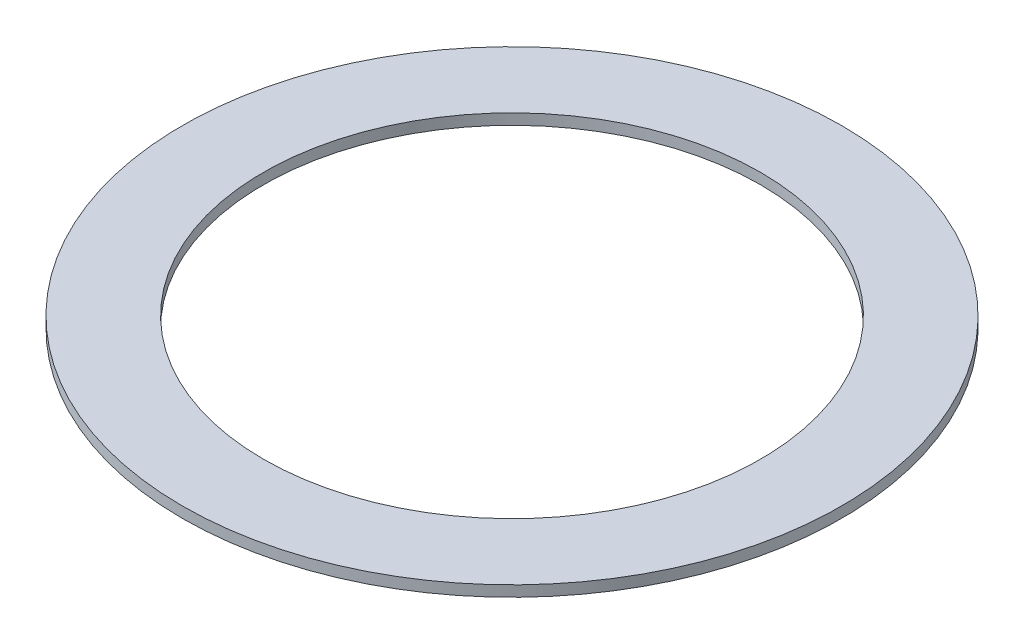
ISO-10303-21;
HEADER;
FILE_DESCRIPTION(('STEP AP214'),'2;1');
FILE_NAME('part.step','',(''),(''),'','','');
FILE_SCHEMA(('AUTOMOTIVE_DESIGN { 1 0 10303 214 1 1 1 1 }'));
ENDSEC;
DATA;
#1=APPLICATION_CONTEXT('core data for automotive mechanical design processes');
#2=APPLICATION_PROTOCOL_DEFINITION('international standard','automotive_design',2000,#1);
#3=PRODUCT_CONTEXT('',#1,'mechanical');
#4=PRODUCT('Part','Part','',(#3));
#5=PRODUCT_RELATED_PRODUCT_CATEGORY('part','',(#4));
#6=PRODUCT_DEFINITION_FORMATION('','',#4);
#7=PRODUCT_DEFINITION_CONTEXT('part definition',#1,'design');
#8=PRODUCT_DEFINITION('design','',#6,#7);
#9=PRODUCT_DEFINITION_SHAPE('','',#8);
#10=(LENGTH_UNIT() NAMED_UNIT(*) SI_UNIT(.MILLI.,.METRE.));
#11=(NAMED_UNIT(*) PLANE_ANGLE_UNIT() SI_UNIT($,.RADIAN.));
#12=(NAMED_UNIT(*) SI_UNIT($,.STERADIAN.) SOLID_ANGLE_UNIT());
#13=UNCERTAINTY_MEASURE_WITH_UNIT(LENGTH_MEASURE(1.E-05),#10,'distance_accuracy_value','');
#14=(GEOMETRIC_REPRESENTATION_CONTEXT(3) GLOBAL_UNCERTAINTY_ASSIGNED_CONTEXT((#13)) GLOBAL_UNIT_ASSIGNED_CONTEXT((#10,
#11,#12)) REPRESENTATION_CONTEXT('',''));
#15=CARTESIAN_POINT('',(0.,0.,0.));
#16=DIRECTION('',(0.,0.,1.));
#17=DIRECTION('',(1.,0.,0.));
#18=AXIS2_PLACEMENT_3D('',#15,#16,#17);
#19=CARTESIAN_POINT('',(0.,0.,0.));
#20=DIRECTION('',(0.,1.,0.));
#21=DIRECTION('',(0.,0.,1.));
#22=AXIS2_PLACEMENT_3D('',#19,#20,#21);
#23=PLANE('',#22);
#24=CARTESIAN_POINT('',(0.,0.,0.));
#25=DIRECTION('',(0.,-1.,0.));
#26=DIRECTION('',(0.,0.,-1.));
#27=AXIS2_PLACEMENT_3D('',#24,#25,#26);
#28=CIRCLE('',#27,18.25625);
#29=CARTESIAN_POINT('',(0.,0.,-18.25625));
#30=VERTEX_POINT('',#29);
#31=EDGE_CURVE('E27',#30,#30,#28,.F.);
#32=ORIENTED_EDGE('',*,*,#31,.T.);
#33=EDGE_LOOP('',(#32));
#34=FACE_BOUND('',#33,.T.);
#35=CARTESIAN_POINT('',(0.,0.,0.));
#36=DIRECTION('',(0.,-1.,0.));
#37=DIRECTION('',(0.,0.,-1.));
#38=AXIS2_PLACEMENT_3D('',#35,#36,#37);
#39=CIRCLE('',#38,24.209375);
#40=CARTESIAN_POINT('',(0.,0.,-24.209375));
#41=VERTEX_POINT('',#40);
#42=EDGE_CURVE('E18',#41,#41,#39,.F.);
#43=ORIENTED_EDGE('',*,*,#42,.F.);
#44=EDGE_LOOP('',(#43));
#45=FACE_BOUND('',#44,.T.);
#46=ADVANCED_FACE('F15',(#34,#45),#23,.F.);
#47=CARTESIAN_POINT('',(0.,0.79375,0.));
#48=DIRECTION('',(0.,-1.,0.));
#49=DIRECTION('',(0.,0.,-1.));
#50=AXIS2_PLACEMENT_3D('',#47,#48,#49);
#51=CYLINDRICAL_SURFACE('',#50,24.209375);
#52=ORIENTED_EDGE('',*,*,#42,.T.);
#53=EDGE_LOOP('',(#52));
#54=FACE_BOUND('',#53,.T.);
#55=CARTESIAN_POINT('',(0.,0.79375,0.));
#56=DIRECTION('',(0.,-1.,0.));
#57=DIRECTION('',(0.,0.,-1.));
#58=AXIS2_PLACEMENT_3D('',#55,#56,#57);
#59=CIRCLE('',#58,24.209375);
#60=CARTESIAN_POINT('',(0.,0.79375,-24.209375));
#61=VERTEX_POINT('',#60);
#62=EDGE_CURVE('E22',#61,#61,#59,.F.);
#63=ORIENTED_EDGE('',*,*,#62,.F.);
#64=EDGE_LOOP('',(#63));
#65=FACE_BOUND('',#64,.T.);
#66=ADVANCED_FACE('F35',(#54,#65),#51,.T.);
#67=CARTESIAN_POINT('',(0.,0.79375,0.));
#68=DIRECTION('',(0.,-1.,0.));
#69=DIRECTION('',(0.,0.,-1.));
#70=AXIS2_PLACEMENT_3D('',#67,#68,#69);
#71=CYLINDRICAL_SURFACE('',#70,18.25625);
#72=CARTESIAN_POINT('',(0.,0.79375,0.));
#73=DIRECTION('',(0.,-1.,0.));
#74=DIRECTION('',(0.,0.,-1.));
#75=AXIS2_PLACEMENT_3D('',#72,#73,#74);
#76=CIRCLE('',#75,18.25625);
#77=CARTESIAN_POINT('',(0.,0.79375,-18.25625));
#78=VERTEX_POINT('',#77);
#79=EDGE_CURVE('E10',#78,#78,#76,.T.);
#80=ORIENTED_EDGE('',*,*,#79,.F.);
#81=EDGE_LOOP('',(#80));
#82=FACE_BOUND('',#81,.T.);
#83=ORIENTED_EDGE('',*,*,#31,.F.);
#84=EDGE_LOOP('',(#83));
#85=FACE_BOUND('',#84,.T.);
#86=ADVANCED_FACE('F43',(#82,#85),#71,.F.);
#87=CARTESIAN_POINT('',(0.,0.79375,0.));
#88=DIRECTION('',(0.,1.,0.));
#89=DIRECTION('',(0.,0.,1.));
#90=AXIS2_PLACEMENT_3D('',#87,#88,#89);
#91=PLANE('',#90);
#92=ORIENTED_EDGE('',*,*,#79,.T.);
#93=EDGE_LOOP('',(#92));
#94=FACE_BOUND('',#93,.T.);
#95=ORIENTED_EDGE('',*,*,#62,.T.);
#96=EDGE_LOOP('',(#95));
#97=FACE_BOUND('',#96,.T.);
#98=ADVANCED_FACE('F44',(#94,#97),#91,.T.);
#99=CLOSED_SHELL('',(#46,#66,#86,#98));
#100=MANIFOLD_SOLID_BREP('B1',#99);
#101=ADVANCED_BREP_SHAPE_REPRESENTATION('',(#18,#100),#14);
#102=SHAPE_DEFINITION_REPRESENTATION(#9,#101);
ENDSEC;
END-ISO-10303-21;
